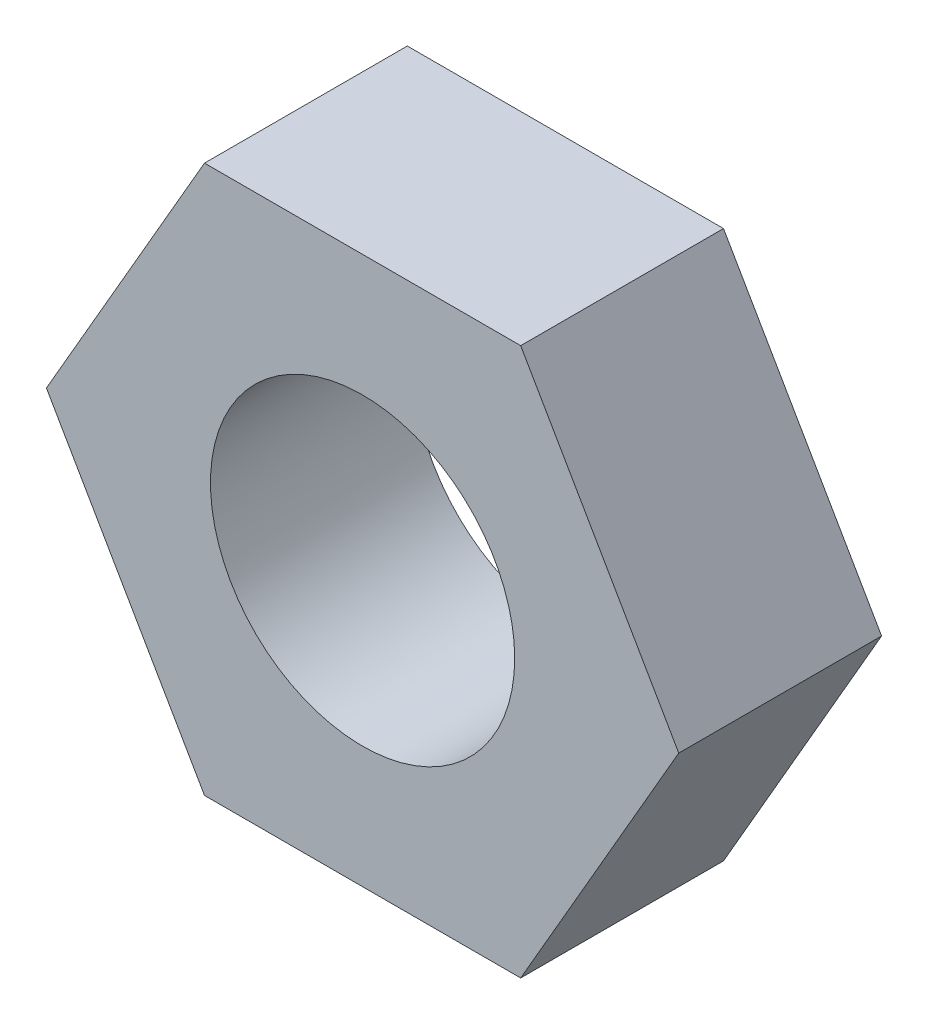
ISO-10303-21;
HEADER;
FILE_DESCRIPTION(('STEP AP214'),'2;1');
FILE_NAME('part.step','',(''),(''),'','','');
FILE_SCHEMA(('AUTOMOTIVE_DESIGN { 1 0 10303 214 1 1 1 1 }'));
ENDSEC;
DATA;
#1=APPLICATION_CONTEXT('core data for automotive mechanical design processes');
#2=APPLICATION_PROTOCOL_DEFINITION('international standard','automotive_design',2000,#1);
#3=PRODUCT_CONTEXT('',#1,'mechanical');
#4=PRODUCT('Part','Part','',(#3));
#5=PRODUCT_RELATED_PRODUCT_CATEGORY('part','',(#4));
#6=PRODUCT_DEFINITION_FORMATION('','',#4);
#7=PRODUCT_DEFINITION_CONTEXT('part definition',#1,'design');
#8=PRODUCT_DEFINITION('design','',#6,#7);
#9=PRODUCT_DEFINITION_SHAPE('','',#8);
#10=(LENGTH_UNIT() NAMED_UNIT(*) SI_UNIT(.MILLI.,.METRE.));
#11=(NAMED_UNIT(*) PLANE_ANGLE_UNIT() SI_UNIT($,.RADIAN.));
#12=(NAMED_UNIT(*) SI_UNIT($,.STERADIAN.) SOLID_ANGLE_UNIT());
#13=UNCERTAINTY_MEASURE_WITH_UNIT(LENGTH_MEASURE(1.E-05),#10,'distance_accuracy_value','');
#14=(GEOMETRIC_REPRESENTATION_CONTEXT(3) GLOBAL_UNCERTAINTY_ASSIGNED_CONTEXT((#13)) GLOBAL_UNIT_ASSIGNED_CONTEXT((#10,
#11,#12)) REPRESENTATION_CONTEXT('',''));
#15=CARTESIAN_POINT('',(0.,0.,0.));
#16=DIRECTION('',(0.,0.,1.));
#17=DIRECTION('',(1.,0.,0.));
#18=AXIS2_PLACEMENT_3D('',#15,#16,#17);
#19=CARTESIAN_POINT('',(0.,0.,6.));
#20=DIRECTION('',(0.,0.,1.));
#21=DIRECTION('',(1.,0.,0.));
#22=AXIS2_PLACEMENT_3D('',#19,#20,#21);
#23=PLANE('',#22);
#24=DIRECTION('',(-0.5,0.866025403784439,0.));
#25=VECTOR('',#24,1.);
#26=CARTESIAN_POINT('',(9.35307436087194,0.,6.));
#27=LINE('',#26,#25);
#28=CARTESIAN_POINT('',(9.35307436087194,0.,6.));
#29=VERTEX_POINT('',#28);
#30=CARTESIAN_POINT('',(4.67653718043597,8.1,6.));
#31=VERTEX_POINT('',#30);
#32=EDGE_CURVE('E129',#29,#31,#27,.T.);
#33=ORIENTED_EDGE('',*,*,#32,.T.);
#34=DIRECTION('',(-1.,0.,0.));
#35=VECTOR('',#34,1.);
#36=CARTESIAN_POINT('',(4.67653718043597,8.1,6.));
#37=LINE('',#36,#35);
#38=CARTESIAN_POINT('',(-4.67653718043597,8.1,6.));
#39=VERTEX_POINT('',#38);
#40=EDGE_CURVE('E87',#31,#39,#37,.T.);
#41=ORIENTED_EDGE('',*,*,#40,.T.);
#42=DIRECTION('',(-0.5,-0.866025403784439,0.));
#43=VECTOR('',#42,1.);
#44=CARTESIAN_POINT('',(-4.67653718043597,8.1,6.));
#45=LINE('',#44,#43);
#46=CARTESIAN_POINT('',(-9.35307436087194,0.,6.));
#47=VERTEX_POINT('',#46);
#48=EDGE_CURVE('E100',#39,#47,#45,.T.);
#49=ORIENTED_EDGE('',*,*,#48,.T.);
#50=DIRECTION('',(0.5,-0.866025403784439,0.));
#51=VECTOR('',#50,1.);
#52=CARTESIAN_POINT('',(-9.35307436087194,0.,6.));
#53=LINE('',#52,#51);
#54=CARTESIAN_POINT('',(-4.67653718043597,-8.1,6.));
#55=VERTEX_POINT('',#54);
#56=EDGE_CURVE('E94',#47,#55,#53,.T.);
#57=ORIENTED_EDGE('',*,*,#56,.T.);
#58=DIRECTION('',(1.,0.,0.));
#59=VECTOR('',#58,1.);
#60=CARTESIAN_POINT('',(-4.67653718043597,-8.1,6.));
#61=LINE('',#60,#59);
#62=CARTESIAN_POINT('',(4.67653718043597,-8.1,6.));
#63=VERTEX_POINT('',#62);
#64=EDGE_CURVE('E98',#55,#63,#61,.T.);
#65=ORIENTED_EDGE('',*,*,#64,.T.);
#66=DIRECTION('',(0.5,0.866025403784439,0.));
#67=VECTOR('',#66,1.);
#68=CARTESIAN_POINT('',(4.67653718043597,-8.1,6.));
#69=LINE('',#68,#67);
#70=EDGE_CURVE('E50',#63,#29,#69,.T.);
#71=ORIENTED_EDGE('',*,*,#70,.T.);
#72=EDGE_LOOP('',(#33,#41,#49,#57,#65,#71));
#73=FACE_BOUND('',#72,.T.);
#74=CARTESIAN_POINT('',(0.,0.,6.));
#75=DIRECTION('',(0.,0.,1.));
#76=DIRECTION('',(1.,0.,0.));
#77=AXIS2_PLACEMENT_3D('',#74,#75,#76);
#78=CIRCLE('',#77,4.5);
#79=CARTESIAN_POINT('',(4.5,0.,6.));
#80=VERTEX_POINT('',#79);
#81=EDGE_CURVE('E122',#80,#80,#78,.T.);
#82=ORIENTED_EDGE('',*,*,#81,.F.);
#83=EDGE_LOOP('',(#82));
#84=FACE_BOUND('',#83,.T.);
#85=ADVANCED_FACE('F33',(#73,#84),#23,.T.);
#86=CARTESIAN_POINT('',(0.,0.,0.));
#87=DIRECTION('',(0.,0.,1.));
#88=DIRECTION('',(1.,0.,0.));
#89=AXIS2_PLACEMENT_3D('',#86,#87,#88);
#90=PLANE('',#89);
#91=DIRECTION('',(-0.5,0.866025403784439,0.));
#92=VECTOR('',#91,1.);
#93=CARTESIAN_POINT('',(9.35307436087194,0.,0.));
#94=LINE('',#93,#92);
#95=CARTESIAN_POINT('',(9.35307436087194,0.,0.));
#96=VERTEX_POINT('',#95);
#97=CARTESIAN_POINT('',(4.67653718043597,8.1,0.));
#98=VERTEX_POINT('',#97);
#99=EDGE_CURVE('E118',#96,#98,#94,.T.);
#100=ORIENTED_EDGE('',*,*,#99,.F.);
#101=DIRECTION('',(0.5,0.866025403784439,0.));
#102=VECTOR('',#101,1.);
#103=CARTESIAN_POINT('',(4.67653718043597,-8.1,0.));
#104=LINE('',#103,#102);
#105=CARTESIAN_POINT('',(4.67653718043597,-8.1,0.));
#106=VERTEX_POINT('',#105);
#107=EDGE_CURVE('E79',#106,#96,#104,.T.);
#108=ORIENTED_EDGE('',*,*,#107,.F.);
#109=DIRECTION('',(1.,0.,0.));
#110=VECTOR('',#109,1.);
#111=CARTESIAN_POINT('',(-4.67653718043597,-8.1,0.));
#112=LINE('',#111,#110);
#113=CARTESIAN_POINT('',(-4.67653718043597,-8.1,0.));
#114=VERTEX_POINT('',#113);
#115=EDGE_CURVE('E73',#114,#106,#112,.T.);
#116=ORIENTED_EDGE('',*,*,#115,.F.);
#117=DIRECTION('',(0.5,-0.866025403784439,0.));
#118=VECTOR('',#117,1.);
#119=CARTESIAN_POINT('',(-9.35307436087194,0.,0.));
#120=LINE('',#119,#118);
#121=CARTESIAN_POINT('',(-9.35307436087194,0.,0.));
#122=VERTEX_POINT('',#121);
#123=EDGE_CURVE('E108',#122,#114,#120,.T.);
#124=ORIENTED_EDGE('',*,*,#123,.F.);
#125=DIRECTION('',(-0.5,-0.866025403784439,0.));
#126=VECTOR('',#125,1.);
#127=CARTESIAN_POINT('',(-4.67653718043597,8.1,0.));
#128=LINE('',#127,#126);
#129=CARTESIAN_POINT('',(-4.67653718043597,8.1,0.));
#130=VERTEX_POINT('',#129);
#131=EDGE_CURVE('E124',#130,#122,#128,.T.);
#132=ORIENTED_EDGE('',*,*,#131,.F.);
#133=DIRECTION('',(-1.,0.,0.));
#134=VECTOR('',#133,1.);
#135=CARTESIAN_POINT('',(4.67653718043597,8.1,0.));
#136=LINE('',#135,#134);
#137=EDGE_CURVE('E121',#98,#130,#136,.T.);
#138=ORIENTED_EDGE('',*,*,#137,.F.);
#139=EDGE_LOOP('',(#100,#108,#116,#124,#132,#138));
#140=FACE_BOUND('',#139,.T.);
#141=CARTESIAN_POINT('',(0.,0.,0.));
#142=DIRECTION('',(0.,0.,1.));
#143=DIRECTION('',(1.,0.,0.));
#144=AXIS2_PLACEMENT_3D('',#141,#142,#143);
#145=CIRCLE('',#144,4.5);
#146=CARTESIAN_POINT('',(4.5,0.,0.));
#147=VERTEX_POINT('',#146);
#148=EDGE_CURVE('E222',#147,#147,#145,.T.);
#149=ORIENTED_EDGE('',*,*,#148,.T.);
#150=EDGE_LOOP('',(#149));
#151=FACE_BOUND('',#150,.T.);
#152=ADVANCED_FACE('F138',(#140,#151),#90,.F.);
#153=CARTESIAN_POINT('',(9.35307436087194,0.,6.));
#154=DIRECTION('',(-0.866025403784439,-0.5,0.));
#155=DIRECTION('',(0.5,-0.866025403784439,0.));
#156=AXIS2_PLACEMENT_3D('',#153,#154,#155);
#157=PLANE('',#156);
#158=ORIENTED_EDGE('',*,*,#99,.T.);
#159=DIRECTION('',(0.,0.,-1.));
#160=VECTOR('',#159,1.);
#161=CARTESIAN_POINT('',(4.67653718043597,8.1,6.));
#162=LINE('',#161,#160);
#163=EDGE_CURVE('E11',#31,#98,#162,.T.);
#164=ORIENTED_EDGE('',*,*,#163,.F.);
#165=ORIENTED_EDGE('',*,*,#32,.F.);
#166=DIRECTION('',(0.,0.,-1.));
#167=VECTOR('',#166,1.);
#168=CARTESIAN_POINT('',(9.35307436087194,0.,6.));
#169=LINE('',#168,#167);
#170=EDGE_CURVE('E114',#29,#96,#169,.T.);
#171=ORIENTED_EDGE('',*,*,#170,.T.);
#172=EDGE_LOOP('',(#158,#164,#165,#171));
#173=FACE_BOUND('',#172,.T.);
#174=ADVANCED_FACE('F35',(#173),#157,.F.);
#175=CARTESIAN_POINT('',(4.67653718043597,8.1,6.));
#176=DIRECTION('',(0.,-1.,0.));
#177=DIRECTION('',(0.,0.,-1.));
#178=AXIS2_PLACEMENT_3D('',#175,#176,#177);
#179=PLANE('',#178);
#180=ORIENTED_EDGE('',*,*,#137,.T.);
#181=DIRECTION('',(0.,0.,-1.));
#182=VECTOR('',#181,1.);
#183=CARTESIAN_POINT('',(-4.67653718043597,8.1,6.));
#184=LINE('',#183,#182);
#185=EDGE_CURVE('E42',#39,#130,#184,.T.);
#186=ORIENTED_EDGE('',*,*,#185,.F.);
#187=ORIENTED_EDGE('',*,*,#40,.F.);
#188=ORIENTED_EDGE('',*,*,#163,.T.);
#189=EDGE_LOOP('',(#180,#186,#187,#188));
#190=FACE_BOUND('',#189,.T.);
#191=ADVANCED_FACE('F163',(#190),#179,.F.);
#192=CARTESIAN_POINT('',(-4.67653718043597,8.1,6.));
#193=DIRECTION('',(0.866025403784439,-0.5,0.));
#194=DIRECTION('',(0.5,0.866025403784439,0.));
#195=AXIS2_PLACEMENT_3D('',#192,#193,#194);
#196=PLANE('',#195);
#197=ORIENTED_EDGE('',*,*,#131,.T.);
#198=DIRECTION('',(0.,0.,-1.));
#199=VECTOR('',#198,1.);
#200=CARTESIAN_POINT('',(-9.35307436087194,0.,6.));
#201=LINE('',#200,#199);
#202=EDGE_CURVE('E109',#47,#122,#201,.T.);
#203=ORIENTED_EDGE('',*,*,#202,.F.);
#204=ORIENTED_EDGE('',*,*,#48,.F.);
#205=ORIENTED_EDGE('',*,*,#185,.T.);
#206=EDGE_LOOP('',(#197,#203,#204,#205));
#207=FACE_BOUND('',#206,.T.);
#208=ADVANCED_FACE('F135',(#207),#196,.F.);
#209=CARTESIAN_POINT('',(-9.35307436087194,0.,6.));
#210=DIRECTION('',(0.866025403784439,0.5,0.));
#211=DIRECTION('',(-0.5,0.866025403784439,0.));
#212=AXIS2_PLACEMENT_3D('',#209,#210,#211);
#213=PLANE('',#212);
#214=ORIENTED_EDGE('',*,*,#123,.T.);
#215=DIRECTION('',(0.,0.,-1.));
#216=VECTOR('',#215,1.);
#217=CARTESIAN_POINT('',(-4.67653718043597,-8.1,6.));
#218=LINE('',#217,#216);
#219=EDGE_CURVE('E105',#55,#114,#218,.T.);
#220=ORIENTED_EDGE('',*,*,#219,.F.);
#221=ORIENTED_EDGE('',*,*,#56,.F.);
#222=ORIENTED_EDGE('',*,*,#202,.T.);
#223=EDGE_LOOP('',(#214,#220,#221,#222));
#224=FACE_BOUND('',#223,.T.);
#225=ADVANCED_FACE('F106',(#224),#213,.F.);
#226=CARTESIAN_POINT('',(-4.67653718043597,-8.1,6.));
#227=DIRECTION('',(0.,1.,0.));
#228=DIRECTION('',(0.,0.,1.));
#229=AXIS2_PLACEMENT_3D('',#226,#227,#228);
#230=PLANE('',#229);
#231=ORIENTED_EDGE('',*,*,#115,.T.);
#232=DIRECTION('',(0.,0.,-1.));
#233=VECTOR('',#232,1.);
#234=CARTESIAN_POINT('',(4.67653718043597,-8.1,6.));
#235=LINE('',#234,#233);
#236=EDGE_CURVE('E110',#63,#106,#235,.T.);
#237=ORIENTED_EDGE('',*,*,#236,.F.);
#238=ORIENTED_EDGE('',*,*,#64,.F.);
#239=ORIENTED_EDGE('',*,*,#219,.T.);
#240=EDGE_LOOP('',(#231,#237,#238,#239));
#241=FACE_BOUND('',#240,.T.);
#242=ADVANCED_FACE('F112',(#241),#230,.F.);
#243=CARTESIAN_POINT('',(4.67653718043597,-8.1,6.));
#244=DIRECTION('',(-0.866025403784439,0.5,0.));
#245=DIRECTION('',(-0.5,-0.866025403784439,0.));
#246=AXIS2_PLACEMENT_3D('',#243,#244,#245);
#247=PLANE('',#246);
#248=ORIENTED_EDGE('',*,*,#107,.T.);
#249=ORIENTED_EDGE('',*,*,#170,.F.);
#250=ORIENTED_EDGE('',*,*,#70,.F.);
#251=ORIENTED_EDGE('',*,*,#236,.T.);
#252=EDGE_LOOP('',(#248,#249,#250,#251));
#253=FACE_BOUND('',#252,.T.);
#254=ADVANCED_FACE('F143',(#253),#247,.F.);
#255=CARTESIAN_POINT('',(0.,0.,6.));
#256=DIRECTION('',(0.,0.,-1.));
#257=DIRECTION('',(-1.,0.,0.));
#258=AXIS2_PLACEMENT_3D('',#255,#256,#257);
#259=CYLINDRICAL_SURFACE('',#258,4.5);
#260=ORIENTED_EDGE('',*,*,#81,.T.);
#261=EDGE_LOOP('',(#260));
#262=FACE_BOUND('',#261,.T.);
#263=ORIENTED_EDGE('',*,*,#148,.F.);
#264=EDGE_LOOP('',(#263));
#265=FACE_BOUND('',#264,.T.);
#266=ADVANCED_FACE('F145',(#262,#265),#259,.F.);
#267=CLOSED_SHELL('',(#85,#152,#174,#191,#208,#225,#242,#254,#266));
#268=MANIFOLD_SOLID_BREP('B2',#267);
#269=ADVANCED_BREP_SHAPE_REPRESENTATION('',(#18,#268),#14);
#270=SHAPE_DEFINITION_REPRESENTATION(#9,#269);
ENDSEC;
END-ISO-10303-21;
